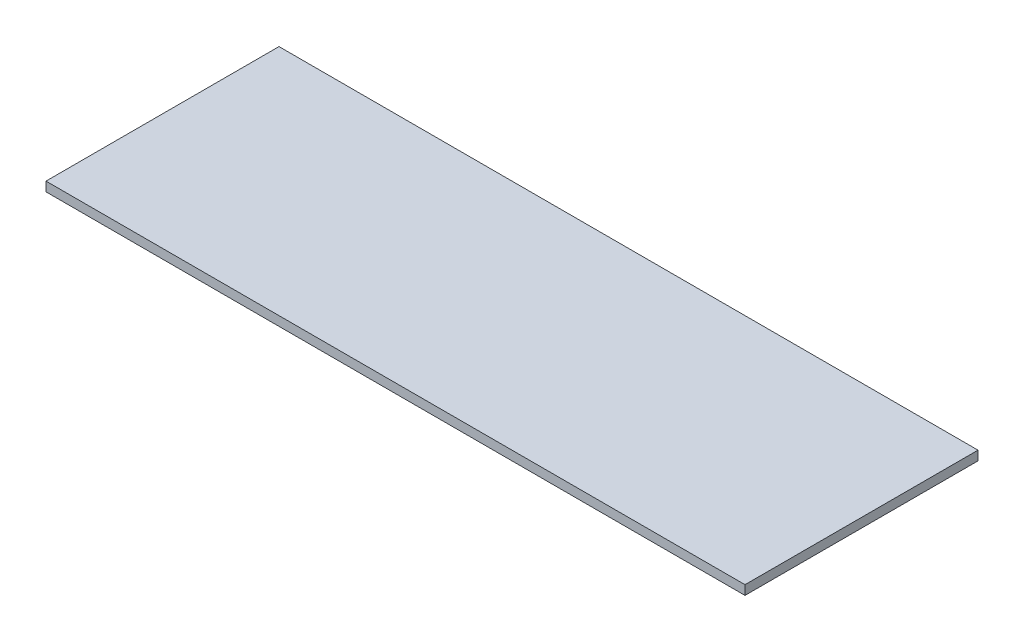
ISO-10303-21;
HEADER;
FILE_DESCRIPTION(('STEP AP214'),'2;1');
FILE_NAME('part.step','',(''),(''),'','','');
FILE_SCHEMA(('AUTOMOTIVE_DESIGN { 1 0 10303 214 1 1 1 1 }'));
ENDSEC;
DATA;
#1=APPLICATION_CONTEXT('core data for automotive mechanical design processes');
#2=APPLICATION_PROTOCOL_DEFINITION('international standard','automotive_design',2000,#1);
#3=PRODUCT_CONTEXT('',#1,'mechanical');
#4=PRODUCT('Part','Part','',(#3));
#5=PRODUCT_RELATED_PRODUCT_CATEGORY('part','',(#4));
#6=PRODUCT_DEFINITION_FORMATION('','',#4);
#7=PRODUCT_DEFINITION_CONTEXT('part definition',#1,'design');
#8=PRODUCT_DEFINITION('design','',#6,#7);
#9=PRODUCT_DEFINITION_SHAPE('','',#8);
#10=(LENGTH_UNIT() NAMED_UNIT(*) SI_UNIT(.MILLI.,.METRE.));
#11=(NAMED_UNIT(*) PLANE_ANGLE_UNIT() SI_UNIT($,.RADIAN.));
#12=(NAMED_UNIT(*) SI_UNIT($,.STERADIAN.) SOLID_ANGLE_UNIT());
#13=UNCERTAINTY_MEASURE_WITH_UNIT(LENGTH_MEASURE(1.E-05),#10,'distance_accuracy_value','');
#14=(GEOMETRIC_REPRESENTATION_CONTEXT(3) GLOBAL_UNCERTAINTY_ASSIGNED_CONTEXT((#13)) GLOBAL_UNIT_ASSIGNED_CONTEXT((#10,
#11,#12)) REPRESENTATION_CONTEXT('',''));
#15=CARTESIAN_POINT('',(0.,0.,0.));
#16=DIRECTION('',(0.,0.,1.));
#17=DIRECTION('',(1.,0.,0.));
#18=AXIS2_PLACEMENT_3D('',#15,#16,#17);
#19=CARTESIAN_POINT('',(0.,1.,0.));
#20=DIRECTION('',(1.,0.,0.));
#21=DIRECTION('',(0.,0.,-1.));
#22=AXIS2_PLACEMENT_3D('',#19,#20,#21);
#23=PLANE('',#22);
#24=DIRECTION('',(0.,0.,1.));
#25=VECTOR('',#24,1.);
#26=CARTESIAN_POINT('',(0.,0.,0.));
#27=LINE('',#26,#25);
#28=CARTESIAN_POINT('',(0.,0.,-25.));
#29=VERTEX_POINT('',#28);
#30=CARTESIAN_POINT('',(0.,0.,0.));
#31=VERTEX_POINT('',#30);
#32=EDGE_CURVE('E95',#29,#31,#27,.T.);
#33=ORIENTED_EDGE('',*,*,#32,.T.);
#34=DIRECTION('',(0.,-1.,0.));
#35=VECTOR('',#34,1.);
#36=CARTESIAN_POINT('',(0.,1.,0.));
#37=LINE('',#36,#35);
#38=CARTESIAN_POINT('',(0.,1.,0.));
#39=VERTEX_POINT('',#38);
#40=EDGE_CURVE('E11',#39,#31,#37,.T.);
#41=ORIENTED_EDGE('',*,*,#40,.F.);
#42=DIRECTION('',(0.,0.,1.));
#43=VECTOR('',#42,1.);
#44=CARTESIAN_POINT('',(0.,1.,0.));
#45=LINE('',#44,#43);
#46=CARTESIAN_POINT('',(0.,1.,-25.));
#47=VERTEX_POINT('',#46);
#48=EDGE_CURVE('E83',#47,#39,#45,.T.);
#49=ORIENTED_EDGE('',*,*,#48,.F.);
#50=DIRECTION('',(0.,-1.,0.));
#51=VECTOR('',#50,1.);
#52=CARTESIAN_POINT('',(0.,1.,-25.));
#53=LINE('',#52,#51);
#54=EDGE_CURVE('E91',#47,#29,#53,.T.);
#55=ORIENTED_EDGE('',*,*,#54,.T.);
#56=EDGE_LOOP('',(#33,#41,#49,#55));
#57=FACE_BOUND('',#56,.T.);
#58=ADVANCED_FACE('F32',(#57),#23,.F.);
#59=CARTESIAN_POINT('',(0.,1.,0.));
#60=DIRECTION('',(0.,0.,-1.));
#61=DIRECTION('',(-1.,0.,0.));
#62=AXIS2_PLACEMENT_3D('',#59,#60,#61);
#63=PLANE('',#62);
#64=DIRECTION('',(1.,0.,0.));
#65=VECTOR('',#64,1.);
#66=CARTESIAN_POINT('',(0.,0.,0.));
#67=LINE('',#66,#65);
#68=CARTESIAN_POINT('',(75.,0.,0.));
#69=VERTEX_POINT('',#68);
#70=EDGE_CURVE('E87',#31,#69,#67,.T.);
#71=ORIENTED_EDGE('',*,*,#70,.T.);
#72=DIRECTION('',(0.,-1.,0.));
#73=VECTOR('',#72,1.);
#74=CARTESIAN_POINT('',(75.,1.,0.));
#75=LINE('',#74,#73);
#76=CARTESIAN_POINT('',(75.,1.,0.));
#77=VERTEX_POINT('',#76);
#78=EDGE_CURVE('E40',#77,#69,#75,.T.);
#79=ORIENTED_EDGE('',*,*,#78,.F.);
#80=DIRECTION('',(1.,0.,0.));
#81=VECTOR('',#80,1.);
#82=CARTESIAN_POINT('',(0.,1.,0.));
#83=LINE('',#82,#81);
#84=EDGE_CURVE('E78',#39,#77,#83,.T.);
#85=ORIENTED_EDGE('',*,*,#84,.F.);
#86=ORIENTED_EDGE('',*,*,#40,.T.);
#87=EDGE_LOOP('',(#71,#79,#85,#86));
#88=FACE_BOUND('',#87,.T.);
#89=ADVANCED_FACE('F86',(#88),#63,.F.);
#90=CARTESIAN_POINT('',(75.,1.,0.));
#91=DIRECTION('',(-1.,0.,0.));
#92=DIRECTION('',(0.,0.,1.));
#93=AXIS2_PLACEMENT_3D('',#90,#91,#92);
#94=PLANE('',#93);
#95=DIRECTION('',(0.,0.,-1.));
#96=VECTOR('',#95,1.);
#97=CARTESIAN_POINT('',(75.,0.,0.));
#98=LINE('',#97,#96);
#99=CARTESIAN_POINT('',(75.,0.,-25.));
#100=VERTEX_POINT('',#99);
#101=EDGE_CURVE('E65',#69,#100,#98,.T.);
#102=ORIENTED_EDGE('',*,*,#101,.T.);
#103=DIRECTION('',(0.,-1.,0.));
#104=VECTOR('',#103,1.);
#105=CARTESIAN_POINT('',(75.,1.,-25.));
#106=LINE('',#105,#104);
#107=CARTESIAN_POINT('',(75.,1.,-25.));
#108=VERTEX_POINT('',#107);
#109=EDGE_CURVE('E88',#108,#100,#106,.T.);
#110=ORIENTED_EDGE('',*,*,#109,.F.);
#111=DIRECTION('',(0.,0.,-1.));
#112=VECTOR('',#111,1.);
#113=CARTESIAN_POINT('',(75.,1.,0.));
#114=LINE('',#113,#112);
#115=EDGE_CURVE('E81',#77,#108,#114,.T.);
#116=ORIENTED_EDGE('',*,*,#115,.F.);
#117=ORIENTED_EDGE('',*,*,#78,.T.);
#118=EDGE_LOOP('',(#102,#110,#116,#117));
#119=FACE_BOUND('',#118,.T.);
#120=ADVANCED_FACE('F89',(#119),#94,.F.);
#121=CARTESIAN_POINT('',(0.,1.,-25.));
#122=DIRECTION('',(0.,0.,1.));
#123=DIRECTION('',(1.,0.,0.));
#124=AXIS2_PLACEMENT_3D('',#121,#122,#123);
#125=PLANE('',#124);
#126=DIRECTION('',(-1.,0.,0.));
#127=VECTOR('',#126,1.);
#128=CARTESIAN_POINT('',(0.,0.,-25.));
#129=LINE('',#128,#127);
#130=EDGE_CURVE('E71',#100,#29,#129,.T.);
#131=ORIENTED_EDGE('',*,*,#130,.T.);
#132=ORIENTED_EDGE('',*,*,#54,.F.);
#133=DIRECTION('',(-1.,0.,0.));
#134=VECTOR('',#133,1.);
#135=CARTESIAN_POINT('',(0.,1.,-25.));
#136=LINE('',#135,#134);
#137=EDGE_CURVE('E48',#108,#47,#136,.T.);
#138=ORIENTED_EDGE('',*,*,#137,.F.);
#139=ORIENTED_EDGE('',*,*,#109,.T.);
#140=EDGE_LOOP('',(#131,#132,#138,#139));
#141=FACE_BOUND('',#140,.T.);
#142=ADVANCED_FACE('F102',(#141),#125,.F.);
#143=CARTESIAN_POINT('',(0.,1.,0.));
#144=DIRECTION('',(0.,-1.,0.));
#145=DIRECTION('',(0.,0.,-1.));
#146=AXIS2_PLACEMENT_3D('',#143,#144,#145);
#147=PLANE('',#146);
#148=ORIENTED_EDGE('',*,*,#48,.T.);
#149=ORIENTED_EDGE('',*,*,#84,.T.);
#150=ORIENTED_EDGE('',*,*,#115,.T.);
#151=ORIENTED_EDGE('',*,*,#137,.T.);
#152=EDGE_LOOP('',(#148,#149,#150,#151));
#153=FACE_BOUND('',#152,.T.);
#154=ADVANCED_FACE('F79',(#153),#147,.F.);
#155=CARTESIAN_POINT('',(0.,0.,0.));
#156=DIRECTION('',(0.,-1.,0.));
#157=DIRECTION('',(0.,0.,-1.));
#158=AXIS2_PLACEMENT_3D('',#155,#156,#157);
#159=PLANE('',#158);
#160=ORIENTED_EDGE('',*,*,#32,.F.);
#161=ORIENTED_EDGE('',*,*,#130,.F.);
#162=ORIENTED_EDGE('',*,*,#101,.F.);
#163=ORIENTED_EDGE('',*,*,#70,.F.);
#164=EDGE_LOOP('',(#160,#161,#162,#163));
#165=FACE_BOUND('',#164,.T.);
#166=ADVANCED_FACE('F105',(#165),#159,.T.);
#167=CLOSED_SHELL('',(#58,#89,#120,#142,#154,#166));
#168=MANIFOLD_SOLID_BREP('B2',#167);
#169=ADVANCED_BREP_SHAPE_REPRESENTATION('',(#18,#168),#14);
#170=SHAPE_DEFINITION_REPRESENTATION(#9,#169);
ENDSEC;
END-ISO-10303-21;
